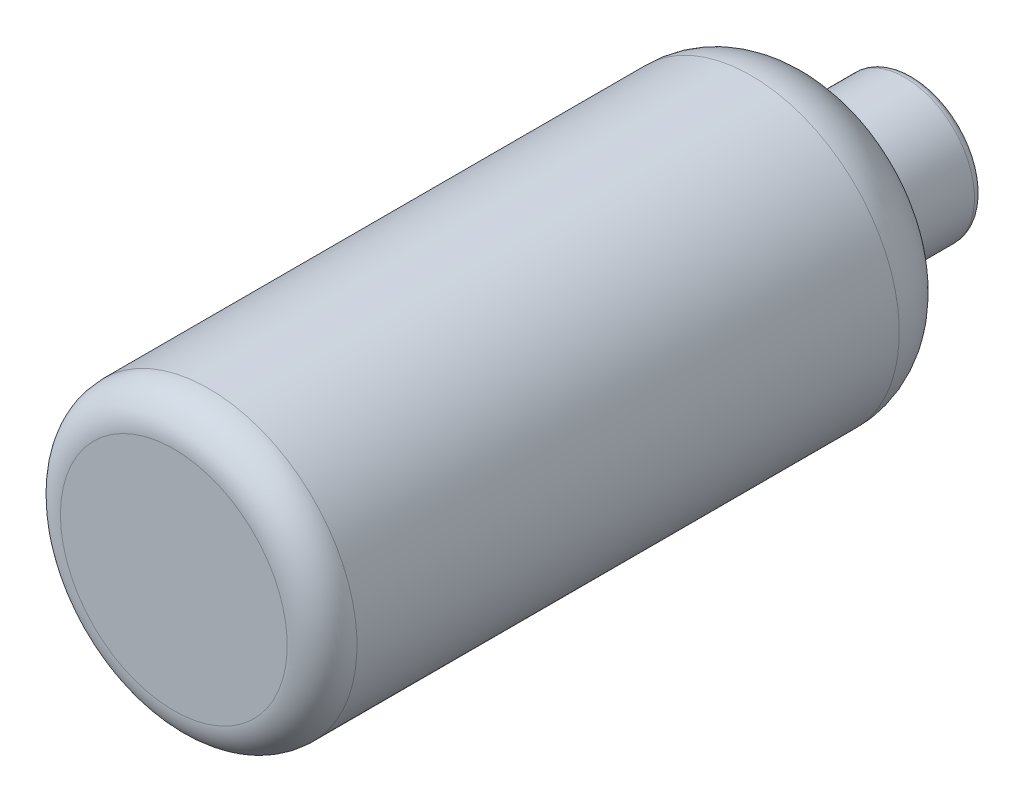
ISO-10303-21;
HEADER;
FILE_DESCRIPTION(('STEP AP214'),'2;1');
FILE_NAME('part.step','',(''),(''),'','','');
FILE_SCHEMA(('AUTOMOTIVE_DESIGN { 1 0 10303 214 1 1 1 1 }'));
ENDSEC;
DATA;
#1=APPLICATION_CONTEXT('core data for automotive mechanical design processes');
#2=APPLICATION_PROTOCOL_DEFINITION('international standard','automotive_design',2000,#1);
#3=PRODUCT_CONTEXT('',#1,'mechanical');
#4=PRODUCT('Part','Part','',(#3));
#5=PRODUCT_RELATED_PRODUCT_CATEGORY('part','',(#4));
#6=PRODUCT_DEFINITION_FORMATION('','',#4);
#7=PRODUCT_DEFINITION_CONTEXT('part definition',#1,'design');
#8=PRODUCT_DEFINITION('design','',#6,#7);
#9=PRODUCT_DEFINITION_SHAPE('','',#8);
#10=(LENGTH_UNIT() NAMED_UNIT(*) SI_UNIT(.MILLI.,.METRE.));
#11=(NAMED_UNIT(*) PLANE_ANGLE_UNIT() SI_UNIT($,.RADIAN.));
#12=(NAMED_UNIT(*) SI_UNIT($,.STERADIAN.) SOLID_ANGLE_UNIT());
#13=UNCERTAINTY_MEASURE_WITH_UNIT(LENGTH_MEASURE(1.E-05),#10,'distance_accuracy_value','');
#14=(GEOMETRIC_REPRESENTATION_CONTEXT(3) GLOBAL_UNCERTAINTY_ASSIGNED_CONTEXT((#13)) GLOBAL_UNIT_ASSIGNED_CONTEXT((#10,
#11,#12)) REPRESENTATION_CONTEXT('',''));
#15=CARTESIAN_POINT('',(0.,0.,0.));
#16=DIRECTION('',(0.,0.,1.));
#17=DIRECTION('',(1.,0.,0.));
#18=AXIS2_PLACEMENT_3D('',#15,#16,#17);
#19=CARTESIAN_POINT('',(0.,0.,-132.08));
#20=DIRECTION('',(0.,0.,-1.));
#21=DIRECTION('',(-1.,0.,0.));
#22=AXIS2_PLACEMENT_3D('',#19,#20,#21);
#23=CYLINDRICAL_SURFACE('',#22,12.7);
#24=CARTESIAN_POINT('',(0.,0.,-133.0325));
#25=DIRECTION('',(0.,0.,-1.));
#26=DIRECTION('',(-1.,0.,0.));
#27=AXIS2_PLACEMENT_3D('',#24,#25,#26);
#28=CIRCLE('',#27,12.7);
#29=CARTESIAN_POINT('',(-12.7,0.,-133.0325));
#30=VERTEX_POINT('',#29);
#31=EDGE_CURVE('E12',#30,#30,#28,.T.);
#32=ORIENTED_EDGE('',*,*,#31,.F.);
#33=EDGE_LOOP('',(#32));
#34=FACE_BOUND('',#33,.T.);
#35=CARTESIAN_POINT('',(0.,0.,-120.84575177948));
#36=DIRECTION('',(0.,0.,-1.));
#37=DIRECTION('',(-1.,0.,0.));
#38=AXIS2_PLACEMENT_3D('',#35,#36,#37);
#39=CIRCLE('',#38,12.7);
#40=CARTESIAN_POINT('',(-12.7,0.,-120.84575177948));
#41=VERTEX_POINT('',#40);
#42=EDGE_CURVE('E85',#41,#41,#39,.T.);
#43=ORIENTED_EDGE('',*,*,#42,.T.);
#44=EDGE_LOOP('',(#43));
#45=FACE_BOUND('',#44,.T.);
#46=ADVANCED_FACE('F42',(#34,#45),#23,.T.);
#47=CARTESIAN_POINT('',(0.,0.,-133.0325));
#48=DIRECTION('',(0.,0.,-1.));
#49=DIRECTION('',(-1.,0.,0.));
#50=AXIS2_PLACEMENT_3D('',#47,#48,#49);
#51=TOROIDAL_SURFACE('',#50,11.1125,1.5875);
#52=CARTESIAN_POINT('',(0.,0.,-134.62));
#53=DIRECTION('',(0.,0.,-1.));
#54=DIRECTION('',(-1.,0.,0.));
#55=AXIS2_PLACEMENT_3D('',#52,#53,#54);
#56=CIRCLE('',#55,11.1125);
#57=CARTESIAN_POINT('',(-11.1125,0.,-134.62));
#58=VERTEX_POINT('',#57);
#59=EDGE_CURVE('E48',#58,#58,#56,.T.);
#60=ORIENTED_EDGE('',*,*,#59,.F.);
#61=EDGE_LOOP('',(#60));
#62=FACE_BOUND('',#61,.T.);
#63=ORIENTED_EDGE('',*,*,#31,.T.);
#64=EDGE_LOOP('',(#63));
#65=FACE_BOUND('',#64,.T.);
#66=ADVANCED_FACE('F102',(#62,#65),#51,.T.);
#67=CARTESIAN_POINT('',(0.,0.,-134.62));
#68=DIRECTION('',(0.,0.,-1.));
#69=DIRECTION('',(-1.,0.,0.));
#70=AXIS2_PLACEMENT_3D('',#67,#68,#69);
#71=PLANE('',#70);
#72=ORIENTED_EDGE('',*,*,#59,.T.);
#73=EDGE_LOOP('',(#72));
#74=FACE_BOUND('',#73,.T.);
#75=CARTESIAN_POINT('',(0.,0.,-134.62));
#76=DIRECTION('',(0.,0.,-1.));
#77=DIRECTION('',(-1.,0.,0.));
#78=AXIS2_PLACEMENT_3D('',#75,#76,#77);
#79=CIRCLE('',#78,10.16);
#80=CARTESIAN_POINT('',(-10.16,0.,-134.62));
#81=VERTEX_POINT('',#80);
#82=EDGE_CURVE('E52',#81,#81,#79,.T.);
#83=ORIENTED_EDGE('',*,*,#82,.F.);
#84=EDGE_LOOP('',(#83));
#85=FACE_BOUND('',#84,.T.);
#86=ADVANCED_FACE('F107',(#74,#85),#71,.T.);
#87=CARTESIAN_POINT('',(0.,0.,-132.08));
#88=DIRECTION('',(0.,0.,-1.));
#89=DIRECTION('',(-1.,0.,0.));
#90=AXIS2_PLACEMENT_3D('',#87,#88,#89);
#91=CYLINDRICAL_SURFACE('',#90,10.16);
#92=ORIENTED_EDGE('',*,*,#82,.T.);
#93=EDGE_LOOP('',(#92));
#94=FACE_BOUND('',#93,.T.);
#95=CARTESIAN_POINT('',(0.,0.,-120.84575177948));
#96=DIRECTION('',(0.,0.,-1.));
#97=DIRECTION('',(-1.,0.,0.));
#98=AXIS2_PLACEMENT_3D('',#95,#96,#97);
#99=CIRCLE('',#98,10.16);
#100=CARTESIAN_POINT('',(-10.16,0.,-120.84575177948));
#101=VERTEX_POINT('',#100);
#102=EDGE_CURVE('E56',#101,#101,#99,.T.);
#103=ORIENTED_EDGE('',*,*,#102,.F.);
#104=EDGE_LOOP('',(#103));
#105=FACE_BOUND('',#104,.T.);
#106=ADVANCED_FACE('F112',(#94,#105),#91,.F.);
#107=CARTESIAN_POINT('',(0.,0.,-120.84575177948));
#108=DIRECTION('',(0.,0.,-1.));
#109=DIRECTION('',(-1.,0.,0.));
#110=AXIS2_PLACEMENT_3D('',#107,#108,#109);
#111=TOROIDAL_SURFACE('',#110,15.875,5.71500000000001);
#112=CARTESIAN_POINT('',(0.,0.,-115.159398576416));
#113=DIRECTION('',(0.,0.,-1.));
#114=DIRECTION('',(-1.,0.,0.));
#115=AXIS2_PLACEMENT_3D('',#112,#113,#114);
#116=CIRCLE('',#115,15.3035);
#117=CARTESIAN_POINT('',(-15.3035,0.,-115.159398576416));
#118=VERTEX_POINT('',#117);
#119=EDGE_CURVE('E61',#118,#118,#116,.T.);
#120=ORIENTED_EDGE('',*,*,#119,.F.);
#121=EDGE_LOOP('',(#120));
#122=FACE_BOUND('',#121,.T.);
#123=ORIENTED_EDGE('',*,*,#102,.T.);
#124=EDGE_LOOP('',(#123));
#125=FACE_BOUND('',#124,.T.);
#126=ADVANCED_FACE('F117',(#122,#125),#111,.T.);
#127=CARTESIAN_POINT('',(0.,0.,-105.050326215413));
#128=DIRECTION('',(0.,0.,-1.));
#129=DIRECTION('',(-1.,0.,0.));
#130=AXIS2_PLACEMENT_3D('',#127,#128,#129);
#131=TOROIDAL_SURFACE('',#130,14.2875,10.16);
#132=ORIENTED_EDGE('',*,*,#119,.T.);
#133=EDGE_LOOP('',(#132));
#134=FACE_BOUND('',#133,.T.);
#135=CARTESIAN_POINT('',(0.,0.,-105.050326215413));
#136=DIRECTION('',(0.,0.,-1.));
#137=DIRECTION('',(-1.,0.,0.));
#138=AXIS2_PLACEMENT_3D('',#135,#136,#137);
#139=CIRCLE('',#138,24.4475);
#140=CARTESIAN_POINT('',(-24.4475,0.,-105.050326215413));
#141=VERTEX_POINT('',#140);
#142=EDGE_CURVE('E64',#141,#141,#139,.T.);
#143=ORIENTED_EDGE('',*,*,#142,.F.);
#144=EDGE_LOOP('',(#143));
#145=FACE_BOUND('',#144,.T.);
#146=ADVANCED_FACE('F121',(#134,#145),#131,.F.);
#147=CARTESIAN_POINT('',(0.,0.,-132.08));
#148=DIRECTION('',(0.,0.,-1.));
#149=DIRECTION('',(-1.,0.,0.));
#150=AXIS2_PLACEMENT_3D('',#147,#148,#149);
#151=CYLINDRICAL_SURFACE('',#150,24.4475);
#152=ORIENTED_EDGE('',*,*,#142,.T.);
#153=EDGE_LOOP('',(#152));
#154=FACE_BOUND('',#153,.T.);
#155=CARTESIAN_POINT('',(0.,0.,-6.35000000000003));
#156=DIRECTION('',(0.,0.,-1.));
#157=DIRECTION('',(-1.,0.,0.));
#158=AXIS2_PLACEMENT_3D('',#155,#156,#157);
#159=CIRCLE('',#158,24.4475);
#160=CARTESIAN_POINT('',(-24.4475,0.,-6.35000000000003));
#161=VERTEX_POINT('',#160);
#162=EDGE_CURVE('E67',#161,#161,#159,.T.);
#163=ORIENTED_EDGE('',*,*,#162,.F.);
#164=EDGE_LOOP('',(#163));
#165=FACE_BOUND('',#164,.T.);
#166=ADVANCED_FACE('F125',(#154,#165),#151,.F.);
#167=CARTESIAN_POINT('',(0.,0.,-6.35));
#168=DIRECTION('',(0.,0.,-1.));
#169=DIRECTION('',(-1.,0.,0.));
#170=AXIS2_PLACEMENT_3D('',#167,#168,#169);
#171=TOROIDAL_SURFACE('',#170,20.6375,3.81);
#172=CARTESIAN_POINT('',(0.,0.,-2.53999999999999));
#173=DIRECTION('',(0.,0.,-1.));
#174=DIRECTION('',(-1.,0.,0.));
#175=AXIS2_PLACEMENT_3D('',#172,#173,#174);
#176=CIRCLE('',#175,20.6375);
#177=CARTESIAN_POINT('',(-20.6375,0.,-2.53999999999999));
#178=VERTEX_POINT('',#177);
#179=EDGE_CURVE('E70',#178,#178,#176,.T.);
#180=ORIENTED_EDGE('',*,*,#179,.F.);
#181=EDGE_LOOP('',(#180));
#182=FACE_BOUND('',#181,.T.);
#183=ORIENTED_EDGE('',*,*,#162,.T.);
#184=EDGE_LOOP('',(#183));
#185=FACE_BOUND('',#184,.T.);
#186=ADVANCED_FACE('F129',(#182,#185),#171,.F.);
#187=CARTESIAN_POINT('',(0.,0.,-2.54000000000001));
#188=DIRECTION('',(0.,0.,-1.));
#189=DIRECTION('',(-1.,0.,0.));
#190=AXIS2_PLACEMENT_3D('',#187,#188,#189);
#191=PLANE('',#190);
#192=ORIENTED_EDGE('',*,*,#179,.T.);
#193=EDGE_LOOP('',(#192));
#194=FACE_BOUND('',#193,.T.);
#195=ADVANCED_FACE('F133',(#194),#191,.T.);
#196=CARTESIAN_POINT('',(0.,0.,0.));
#197=DIRECTION('',(0.,0.,-1.));
#198=DIRECTION('',(-1.,0.,0.));
#199=AXIS2_PLACEMENT_3D('',#196,#197,#198);
#200=PLANE('',#199);
#201=CARTESIAN_POINT('',(0.,0.,0.));
#202=DIRECTION('',(0.,0.,-1.));
#203=DIRECTION('',(-1.,0.,0.));
#204=AXIS2_PLACEMENT_3D('',#201,#202,#203);
#205=CIRCLE('',#204,20.6375);
#206=CARTESIAN_POINT('',(-20.6375,0.,0.));
#207=VERTEX_POINT('',#206);
#208=EDGE_CURVE('E73',#207,#207,#205,.T.);
#209=ORIENTED_EDGE('',*,*,#208,.F.);
#210=EDGE_LOOP('',(#209));
#211=FACE_BOUND('',#210,.T.);
#212=ADVANCED_FACE('F137',(#211),#200,.F.);
#213=CARTESIAN_POINT('',(0.,0.,-6.35));
#214=DIRECTION('',(0.,0.,-1.));
#215=DIRECTION('',(-1.,0.,0.));
#216=AXIS2_PLACEMENT_3D('',#213,#214,#215);
#217=TOROIDAL_SURFACE('',#216,20.6375,6.35);
#218=ORIENTED_EDGE('',*,*,#208,.T.);
#219=EDGE_LOOP('',(#218));
#220=FACE_BOUND('',#219,.T.);
#221=CARTESIAN_POINT('',(0.,0.,-6.35000000000005));
#222=DIRECTION('',(0.,0.,-1.));
#223=DIRECTION('',(-1.,0.,0.));
#224=AXIS2_PLACEMENT_3D('',#221,#222,#223);
#225=CIRCLE('',#224,26.9875);
#226=CARTESIAN_POINT('',(-26.9875,0.,-6.35000000000005));
#227=VERTEX_POINT('',#226);
#228=EDGE_CURVE('E76',#227,#227,#225,.T.);
#229=ORIENTED_EDGE('',*,*,#228,.F.);
#230=EDGE_LOOP('',(#229));
#231=FACE_BOUND('',#230,.T.);
#232=ADVANCED_FACE('F141',(#220,#231),#217,.T.);
#233=CARTESIAN_POINT('',(0.,0.,-132.08));
#234=DIRECTION('',(0.,0.,-1.));
#235=DIRECTION('',(-1.,0.,0.));
#236=AXIS2_PLACEMENT_3D('',#233,#234,#235);
#237=CYLINDRICAL_SURFACE('',#236,26.9875);
#238=CARTESIAN_POINT('',(0.,0.,-105.050326215413));
#239=DIRECTION('',(0.,0.,-1.));
#240=DIRECTION('',(-1.,0.,0.));
#241=AXIS2_PLACEMENT_3D('',#238,#239,#240);
#242=CIRCLE('',#241,26.9875);
#243=CARTESIAN_POINT('',(-26.9875,0.,-105.050326215413));
#244=VERTEX_POINT('',#243);
#245=EDGE_CURVE('E79',#244,#244,#242,.T.);
#246=ORIENTED_EDGE('',*,*,#245,.F.);
#247=EDGE_LOOP('',(#246));
#248=FACE_BOUND('',#247,.T.);
#249=ORIENTED_EDGE('',*,*,#228,.T.);
#250=EDGE_LOOP('',(#249));
#251=FACE_BOUND('',#250,.T.);
#252=ADVANCED_FACE('F98',(#248,#251),#237,.T.);
#253=CARTESIAN_POINT('',(0.,0.,-105.050326215413));
#254=DIRECTION('',(0.,0.,-1.));
#255=DIRECTION('',(-1.,0.,0.));
#256=AXIS2_PLACEMENT_3D('',#253,#254,#255);
#257=TOROIDAL_SURFACE('',#256,14.2875,12.7);
#258=CARTESIAN_POINT('',(0.,0.,-117.686666666667));
#259=DIRECTION('',(0.,0.,-1.));
#260=DIRECTION('',(-1.,0.,0.));
#261=AXIS2_PLACEMENT_3D('',#258,#259,#260);
#262=CIRCLE('',#261,15.5575);
#263=CARTESIAN_POINT('',(-15.5575,0.,-117.686666666667));
#264=VERTEX_POINT('',#263);
#265=EDGE_CURVE('E82',#264,#264,#262,.T.);
#266=ORIENTED_EDGE('',*,*,#265,.F.);
#267=EDGE_LOOP('',(#266));
#268=FACE_BOUND('',#267,.T.);
#269=ORIENTED_EDGE('',*,*,#245,.T.);
#270=EDGE_LOOP('',(#269));
#271=FACE_BOUND('',#270,.T.);
#272=ADVANCED_FACE('F92',(#268,#271),#257,.T.);
#273=CARTESIAN_POINT('',(0.,0.,-120.84575177948));
#274=DIRECTION('',(0.,0.,-1.));
#275=DIRECTION('',(-1.,0.,0.));
#276=AXIS2_PLACEMENT_3D('',#273,#274,#275);
#277=TOROIDAL_SURFACE('',#276,15.875,3.17500000000001);
#278=ORIENTED_EDGE('',*,*,#265,.T.);
#279=EDGE_LOOP('',(#278));
#280=FACE_BOUND('',#279,.T.);
#281=ORIENTED_EDGE('',*,*,#42,.F.);
#282=EDGE_LOOP('',(#281));
#283=FACE_BOUND('',#282,.T.);
#284=ADVANCED_FACE('F90',(#280,#283),#277,.F.);
#285=CLOSED_SHELL('',(#46,#66,#86,#106,#126,#146,#166,#186,#195,#212,#232,#252,#272,#284));
#286=MANIFOLD_SOLID_BREP('B2',#285);
#287=ADVANCED_BREP_SHAPE_REPRESENTATION('',(#18,#286),#14);
#288=SHAPE_DEFINITION_REPRESENTATION(#9,#287);
ENDSEC;
END-ISO-10303-21;
